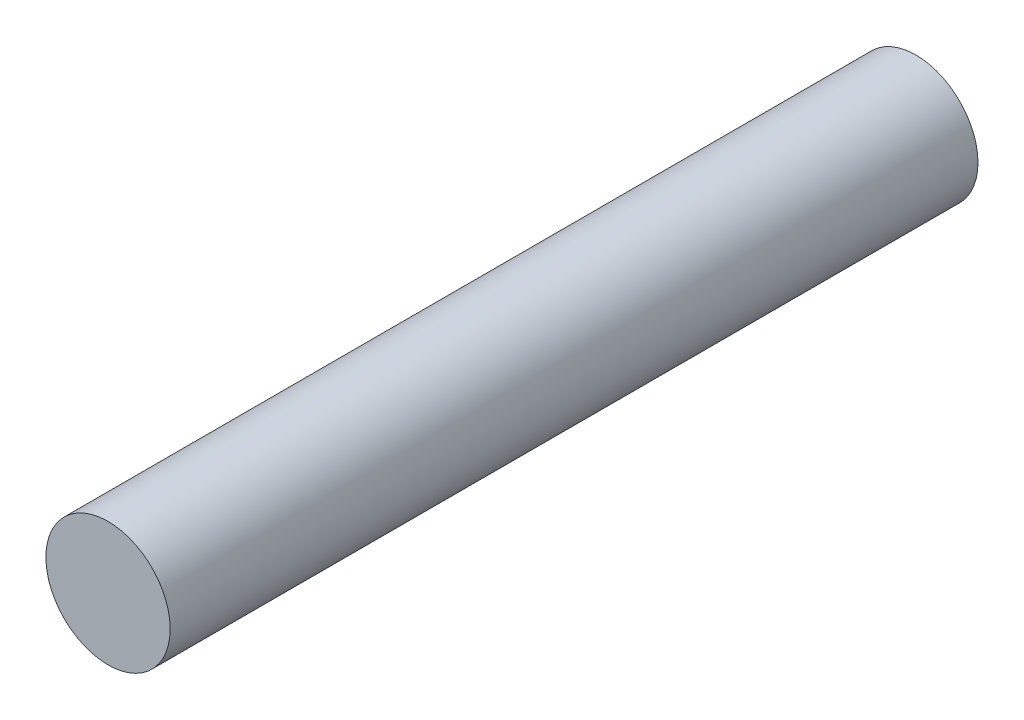
ISO-10303-21;
HEADER;
FILE_DESCRIPTION(('STEP AP214'),'2;1');
FILE_NAME('part.step','',(''),(''),'','','');
FILE_SCHEMA(('AUTOMOTIVE_DESIGN { 1 0 10303 214 1 1 1 1 }'));
ENDSEC;
DATA;
#1=APPLICATION_CONTEXT('core data for automotive mechanical design processes');
#2=APPLICATION_PROTOCOL_DEFINITION('international standard','automotive_design',2000,#1);
#3=PRODUCT_CONTEXT('',#1,'mechanical');
#4=PRODUCT('Part','Part','',(#3));
#5=PRODUCT_RELATED_PRODUCT_CATEGORY('part','',(#4));
#6=PRODUCT_DEFINITION_FORMATION('','',#4);
#7=PRODUCT_DEFINITION_CONTEXT('part definition',#1,'design');
#8=PRODUCT_DEFINITION('design','',#6,#7);
#9=PRODUCT_DEFINITION_SHAPE('','',#8);
#10=(LENGTH_UNIT() NAMED_UNIT(*) SI_UNIT(.MILLI.,.METRE.));
#11=(NAMED_UNIT(*) PLANE_ANGLE_UNIT() SI_UNIT($,.RADIAN.));
#12=(NAMED_UNIT(*) SI_UNIT($,.STERADIAN.) SOLID_ANGLE_UNIT());
#13=UNCERTAINTY_MEASURE_WITH_UNIT(LENGTH_MEASURE(1.E-05),#10,'distance_accuracy_value','');
#14=(GEOMETRIC_REPRESENTATION_CONTEXT(3) GLOBAL_UNCERTAINTY_ASSIGNED_CONTEXT((#13)) GLOBAL_UNIT_ASSIGNED_CONTEXT((#10,
#11,#12)) REPRESENTATION_CONTEXT('',''));
#15=CARTESIAN_POINT('',(0.,0.,0.));
#16=DIRECTION('',(0.,0.,1.));
#17=DIRECTION('',(1.,0.,0.));
#18=AXIS2_PLACEMENT_3D('',#15,#16,#17);
#19=CARTESIAN_POINT('',(0.,0.,13.));
#20=DIRECTION('',(0.,0.,-1.));
#21=DIRECTION('',(-1.,0.,0.));
#22=AXIS2_PLACEMENT_3D('',#19,#20,#21);
#23=CYLINDRICAL_SURFACE('',#22,1.);
#24=CARTESIAN_POINT('',(0.,0.,13.));
#25=DIRECTION('',(0.,0.,1.));
#26=DIRECTION('',(1.,0.,0.));
#27=AXIS2_PLACEMENT_3D('',#24,#25,#26);
#28=CIRCLE('',#27,1.);
#29=CARTESIAN_POINT('',(1.,0.,13.));
#30=VERTEX_POINT('',#29);
#31=EDGE_CURVE('E10',#30,#30,#28,.T.);
#32=ORIENTED_EDGE('',*,*,#31,.F.);
#33=EDGE_LOOP('',(#32));
#34=FACE_BOUND('',#33,.T.);
#35=CARTESIAN_POINT('',(0.,0.,0.));
#36=DIRECTION('',(0.,0.,1.));
#37=DIRECTION('',(1.,0.,0.));
#38=AXIS2_PLACEMENT_3D('',#35,#36,#37);
#39=CIRCLE('',#38,1.);
#40=CARTESIAN_POINT('',(1.,0.,0.));
#41=VERTEX_POINT('',#40);
#42=EDGE_CURVE('E41',#41,#41,#39,.T.);
#43=ORIENTED_EDGE('',*,*,#42,.T.);
#44=EDGE_LOOP('',(#43));
#45=FACE_BOUND('',#44,.T.);
#46=ADVANCED_FACE('F38',(#34,#45),#23,.T.);
#47=CARTESIAN_POINT('',(0.,0.,13.));
#48=DIRECTION('',(0.,0.,1.));
#49=DIRECTION('',(1.,0.,0.));
#50=AXIS2_PLACEMENT_3D('',#47,#48,#49);
#51=PLANE('',#50);
#52=ORIENTED_EDGE('',*,*,#31,.T.);
#53=EDGE_LOOP('',(#52));
#54=FACE_BOUND('',#53,.T.);
#55=ADVANCED_FACE('F55',(#54),#51,.T.);
#56=CARTESIAN_POINT('',(0.,0.,0.));
#57=DIRECTION('',(0.,0.,1.));
#58=DIRECTION('',(1.,0.,0.));
#59=AXIS2_PLACEMENT_3D('',#56,#57,#58);
#60=PLANE('',#59);
#61=ORIENTED_EDGE('',*,*,#42,.F.);
#62=EDGE_LOOP('',(#61));
#63=FACE_BOUND('',#62,.T.);
#64=ADVANCED_FACE('F53',(#63),#60,.F.);
#65=CLOSED_SHELL('',(#46,#55,#64));
#66=MANIFOLD_SOLID_BREP('B2',#65);
#67=ADVANCED_BREP_SHAPE_REPRESENTATION('',(#18,#66),#14);
#68=SHAPE_DEFINITION_REPRESENTATION(#9,#67);
ENDSEC;
END-ISO-10303-21;
